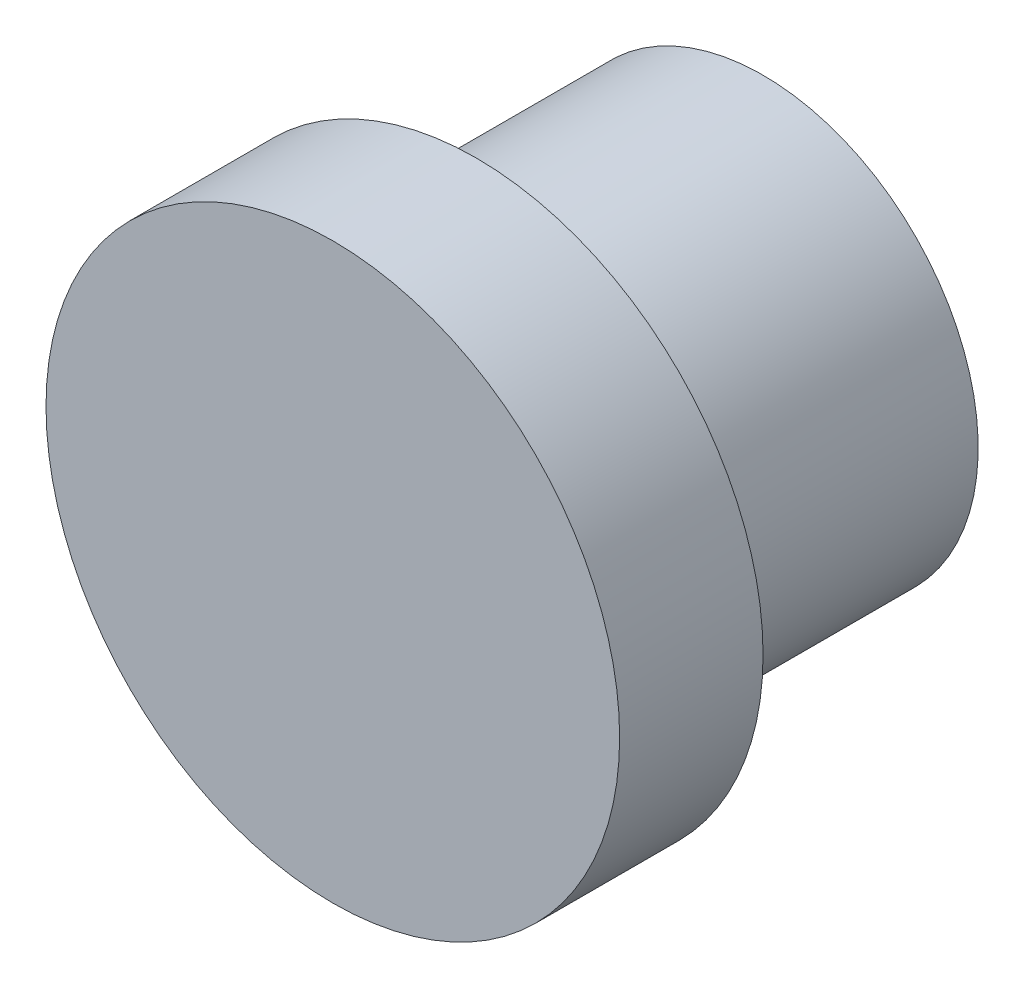
ISO-10303-21;
HEADER;
FILE_DESCRIPTION(('STEP AP214'),'2;1');
FILE_NAME('part.step','',(''),(''),'','','');
FILE_SCHEMA(('AUTOMOTIVE_DESIGN { 1 0 10303 214 1 1 1 1 }'));
ENDSEC;
DATA;
#1=APPLICATION_CONTEXT('core data for automotive mechanical design processes');
#2=APPLICATION_PROTOCOL_DEFINITION('international standard','automotive_design',2000,#1);
#3=PRODUCT_CONTEXT('',#1,'mechanical');
#4=PRODUCT('Part','Part','',(#3));
#5=PRODUCT_RELATED_PRODUCT_CATEGORY('part','',(#4));
#6=PRODUCT_DEFINITION_FORMATION('','',#4);
#7=PRODUCT_DEFINITION_CONTEXT('part definition',#1,'design');
#8=PRODUCT_DEFINITION('design','',#6,#7);
#9=PRODUCT_DEFINITION_SHAPE('','',#8);
#10=(LENGTH_UNIT() NAMED_UNIT(*) SI_UNIT(.MILLI.,.METRE.));
#11=(NAMED_UNIT(*) PLANE_ANGLE_UNIT() SI_UNIT($,.RADIAN.));
#12=(NAMED_UNIT(*) SI_UNIT($,.STERADIAN.) SOLID_ANGLE_UNIT());
#13=UNCERTAINTY_MEASURE_WITH_UNIT(LENGTH_MEASURE(1.E-05),#10,'distance_accuracy_value','');
#14=(GEOMETRIC_REPRESENTATION_CONTEXT(3) GLOBAL_UNCERTAINTY_ASSIGNED_CONTEXT((#13)) GLOBAL_UNIT_ASSIGNED_CONTEXT((#10,
#11,#12)) REPRESENTATION_CONTEXT('',''));
#15=CARTESIAN_POINT('',(0.,0.,0.));
#16=DIRECTION('',(0.,0.,1.));
#17=DIRECTION('',(1.,0.,0.));
#18=AXIS2_PLACEMENT_3D('',#15,#16,#17);
#19=CARTESIAN_POINT('',(0.,0.,12.));
#20=DIRECTION('',(0.,0.,-1.));
#21=DIRECTION('',(-1.,0.,0.));
#22=AXIS2_PLACEMENT_3D('',#19,#20,#21);
#23=CYLINDRICAL_SURFACE('',#22,8.);
#24=CARTESIAN_POINT('',(0.,0.,12.));
#25=DIRECTION('',(0.,0.,1.));
#26=DIRECTION('',(1.,0.,0.));
#27=AXIS2_PLACEMENT_3D('',#24,#25,#26);
#28=CIRCLE('',#27,8.);
#29=CARTESIAN_POINT('',(8.00000000000001,0.,12.));
#30=VERTEX_POINT('',#29);
#31=EDGE_CURVE('E13',#30,#30,#28,.T.);
#32=ORIENTED_EDGE('',*,*,#31,.F.);
#33=EDGE_LOOP('',(#32));
#34=FACE_BOUND('',#33,.T.);
#35=CARTESIAN_POINT('',(0.,0.,8.));
#36=DIRECTION('',(0.,0.,-1.));
#37=DIRECTION('',(-1.,0.,0.));
#38=AXIS2_PLACEMENT_3D('',#35,#36,#37);
#39=CIRCLE('',#38,8.);
#40=CARTESIAN_POINT('',(-8.00000000000001,0.,8.));
#41=VERTEX_POINT('',#40);
#42=EDGE_CURVE('E50',#41,#41,#39,.T.);
#43=ORIENTED_EDGE('',*,*,#42,.F.);
#44=EDGE_LOOP('',(#43));
#45=FACE_BOUND('',#44,.T.);
#46=ADVANCED_FACE('F47',(#34,#45),#23,.T.);
#47=CARTESIAN_POINT('',(0.,0.,12.));
#48=DIRECTION('',(0.,0.,1.));
#49=DIRECTION('',(1.,0.,0.));
#50=AXIS2_PLACEMENT_3D('',#47,#48,#49);
#51=PLANE('',#50);
#52=ORIENTED_EDGE('',*,*,#31,.T.);
#53=EDGE_LOOP('',(#52));
#54=FACE_BOUND('',#53,.T.);
#55=ADVANCED_FACE('F71',(#54),#51,.T.);
#56=CARTESIAN_POINT('',(0.,0.,8.));
#57=DIRECTION('',(0.,0.,-1.));
#58=DIRECTION('',(-1.,0.,0.));
#59=AXIS2_PLACEMENT_3D('',#56,#57,#58);
#60=PLANE('',#59);
#61=CARTESIAN_POINT('',(0.,0.,8.));
#62=DIRECTION('',(0.,0.,-1.));
#63=DIRECTION('',(-1.,0.,0.));
#64=AXIS2_PLACEMENT_3D('',#61,#62,#63);
#65=CIRCLE('',#64,6.);
#66=CARTESIAN_POINT('',(-6.00000000000001,0.,8.));
#67=VERTEX_POINT('',#66);
#68=EDGE_CURVE('E57',#67,#67,#65,.T.);
#69=ORIENTED_EDGE('',*,*,#68,.F.);
#70=EDGE_LOOP('',(#69));
#71=FACE_BOUND('',#70,.T.);
#72=ORIENTED_EDGE('',*,*,#42,.T.);
#73=EDGE_LOOP('',(#72));
#74=FACE_BOUND('',#73,.T.);
#75=ADVANCED_FACE('F68',(#71,#74),#60,.T.);
#76=CARTESIAN_POINT('',(0.,0.,8.));
#77=DIRECTION('',(0.,0.,-1.));
#78=DIRECTION('',(-1.,0.,0.));
#79=AXIS2_PLACEMENT_3D('',#76,#77,#78);
#80=CYLINDRICAL_SURFACE('',#79,6.);
#81=ORIENTED_EDGE('',*,*,#68,.T.);
#82=EDGE_LOOP('',(#81));
#83=FACE_BOUND('',#82,.T.);
#84=CARTESIAN_POINT('',(0.,0.,0.));
#85=DIRECTION('',(0.,0.,-1.));
#86=DIRECTION('',(-1.,0.,0.));
#87=AXIS2_PLACEMENT_3D('',#84,#85,#86);
#88=CIRCLE('',#87,6.);
#89=CARTESIAN_POINT('',(-6.00000000000001,0.,0.));
#90=VERTEX_POINT('',#89);
#91=EDGE_CURVE('E59',#90,#90,#88,.T.);
#92=ORIENTED_EDGE('',*,*,#91,.F.);
#93=EDGE_LOOP('',(#92));
#94=FACE_BOUND('',#93,.T.);
#95=ADVANCED_FACE('F65',(#83,#94),#80,.T.);
#96=CARTESIAN_POINT('',(0.,0.,0.));
#97=DIRECTION('',(0.,0.,1.));
#98=DIRECTION('',(1.,0.,0.));
#99=AXIS2_PLACEMENT_3D('',#96,#97,#98);
#100=PLANE('',#99);
#101=ORIENTED_EDGE('',*,*,#91,.T.);
#102=EDGE_LOOP('',(#101));
#103=FACE_BOUND('',#102,.T.);
#104=ADVANCED_FACE('F84',(#103),#100,.F.);
#105=CLOSED_SHELL('',(#46,#55,#75,#95,#104));
#106=MANIFOLD_SOLID_BREP('B2',#105);
#107=ADVANCED_BREP_SHAPE_REPRESENTATION('',(#18,#106),#14);
#108=SHAPE_DEFINITION_REPRESENTATION(#9,#107);
ENDSEC;
END-ISO-10303-21;
